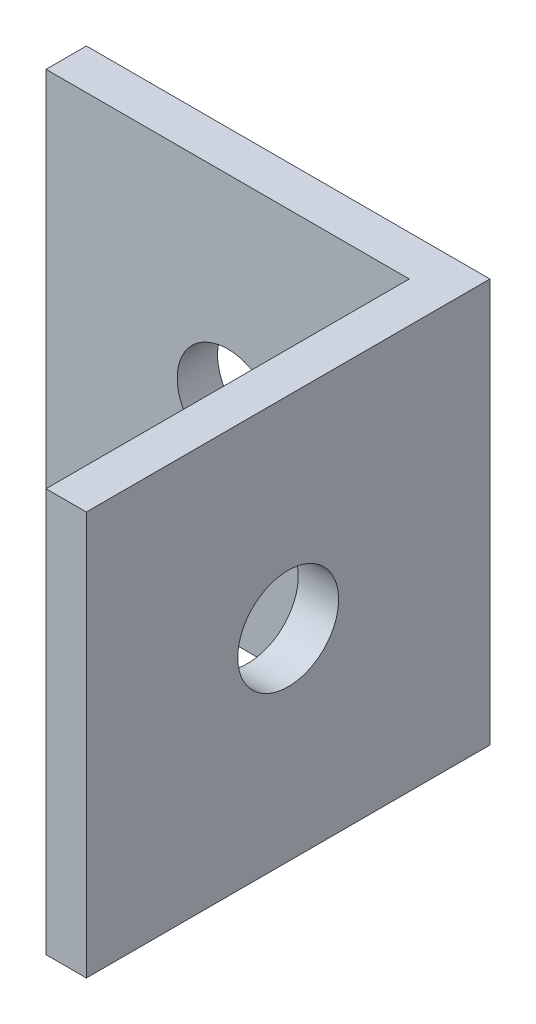
ISO-10303-21;
HEADER;
FILE_DESCRIPTION(('STEP AP214'),'2;1');
FILE_NAME('part.step','',(''),(''),'','','');
FILE_SCHEMA(('AUTOMOTIVE_DESIGN { 1 0 10303 214 1 1 1 1 }'));
ENDSEC;
DATA;
#1=APPLICATION_CONTEXT('core data for automotive mechanical design processes');
#2=APPLICATION_PROTOCOL_DEFINITION('international standard','automotive_design',2000,#1);
#3=PRODUCT_CONTEXT('',#1,'mechanical');
#4=PRODUCT('Part','Part','',(#3));
#5=PRODUCT_RELATED_PRODUCT_CATEGORY('part','',(#4));
#6=PRODUCT_DEFINITION_FORMATION('','',#4);
#7=PRODUCT_DEFINITION_CONTEXT('part definition',#1,'design');
#8=PRODUCT_DEFINITION('design','',#6,#7);
#9=PRODUCT_DEFINITION_SHAPE('','',#8);
#10=(LENGTH_UNIT() NAMED_UNIT(*) SI_UNIT(.MILLI.,.METRE.));
#11=(NAMED_UNIT(*) PLANE_ANGLE_UNIT() SI_UNIT($,.RADIAN.));
#12=(NAMED_UNIT(*) SI_UNIT($,.STERADIAN.) SOLID_ANGLE_UNIT());
#13=UNCERTAINTY_MEASURE_WITH_UNIT(LENGTH_MEASURE(1.E-05),#10,'distance_accuracy_value','');
#14=(GEOMETRIC_REPRESENTATION_CONTEXT(3) GLOBAL_UNCERTAINTY_ASSIGNED_CONTEXT((#13)) GLOBAL_UNIT_ASSIGNED_CONTEXT((#10,
#11,#12)) REPRESENTATION_CONTEXT('',''));
#15=CARTESIAN_POINT('',(0.,0.,0.));
#16=DIRECTION('',(0.,0.,1.));
#17=DIRECTION('',(1.,0.,0.));
#18=AXIS2_PLACEMENT_3D('',#15,#16,#17);
#19=CARTESIAN_POINT('',(0.,0.,2.54));
#20=DIRECTION('',(0.,0.,-1.));
#21=DIRECTION('',(-1.,0.,0.));
#22=AXIS2_PLACEMENT_3D('',#19,#20,#21);
#23=PLANE('',#22);
#24=CARTESIAN_POINT('',(11.43,12.7,2.54));
#25=DIRECTION('',(0.,0.,1.));
#26=DIRECTION('',(1.,0.,0.));
#27=AXIS2_PLACEMENT_3D('',#24,#25,#26);
#28=CIRCLE('',#27,3.175);
#29=CARTESIAN_POINT('',(14.605,12.7,2.54));
#30=VERTEX_POINT('',#29);
#31=EDGE_CURVE('E276',#30,#30,#28,.T.);
#32=ORIENTED_EDGE('',*,*,#31,.F.);
#33=EDGE_LOOP('',(#32));
#34=FACE_BOUND('',#33,.T.);
#35=DIRECTION('',(0.,-1.,0.));
#36=VECTOR('',#35,1.);
#37=CARTESIAN_POINT('',(22.86,0.,2.54));
#38=LINE('',#37,#36);
#39=CARTESIAN_POINT('',(22.86,25.4,2.54));
#40=VERTEX_POINT('',#39);
#41=CARTESIAN_POINT('',(22.86,0.,2.54));
#42=VERTEX_POINT('',#41);
#43=EDGE_CURVE('E55',#40,#42,#38,.T.);
#44=ORIENTED_EDGE('',*,*,#43,.F.);
#45=DIRECTION('',(-1.,0.,0.));
#46=VECTOR('',#45,1.);
#47=CARTESIAN_POINT('',(0.,25.4,2.54));
#48=LINE('',#47,#46);
#49=CARTESIAN_POINT('',(0.,25.4,2.54));
#50=VERTEX_POINT('',#49);
#51=EDGE_CURVE('E98',#40,#50,#48,.T.);
#52=ORIENTED_EDGE('',*,*,#51,.T.);
#53=DIRECTION('',(0.,-1.,0.));
#54=VECTOR('',#53,1.);
#55=CARTESIAN_POINT('',(0.,0.,2.54));
#56=LINE('',#55,#54);
#57=CARTESIAN_POINT('',(0.,0.,2.54));
#58=VERTEX_POINT('',#57);
#59=EDGE_CURVE('E131',#50,#58,#56,.T.);
#60=ORIENTED_EDGE('',*,*,#59,.T.);
#61=DIRECTION('',(1.,0.,0.));
#62=VECTOR('',#61,1.);
#63=CARTESIAN_POINT('',(0.,0.,2.54));
#64=LINE('',#63,#62);
#65=EDGE_CURVE('E60',#58,#42,#64,.T.);
#66=ORIENTED_EDGE('',*,*,#65,.T.);
#67=EDGE_LOOP('',(#44,#52,#60,#66));
#68=FACE_BOUND('',#67,.T.);
#69=ADVANCED_FACE('F39',(#34,#68),#23,.F.);
#70=CARTESIAN_POINT('',(0.,0.,2.54));
#71=DIRECTION('',(1.,0.,0.));
#72=DIRECTION('',(0.,0.,-1.));
#73=AXIS2_PLACEMENT_3D('',#70,#71,#72);
#74=PLANE('',#73);
#75=DIRECTION('',(0.,-1.,0.));
#76=VECTOR('',#75,1.);
#77=CARTESIAN_POINT('',(0.,0.,0.));
#78=LINE('',#77,#76);
#79=CARTESIAN_POINT('',(0.,25.4,0.));
#80=VERTEX_POINT('',#79);
#81=CARTESIAN_POINT('',(0.,0.,0.));
#82=VERTEX_POINT('',#81);
#83=EDGE_CURVE('E130',#80,#82,#78,.T.);
#84=ORIENTED_EDGE('',*,*,#83,.T.);
#85=DIRECTION('',(0.,0.,-1.));
#86=VECTOR('',#85,1.);
#87=CARTESIAN_POINT('',(0.,0.,2.54));
#88=LINE('',#87,#86);
#89=EDGE_CURVE('E11',#58,#82,#88,.T.);
#90=ORIENTED_EDGE('',*,*,#89,.F.);
#91=ORIENTED_EDGE('',*,*,#59,.F.);
#92=DIRECTION('',(0.,0.,-1.));
#93=VECTOR('',#92,1.);
#94=CARTESIAN_POINT('',(0.,25.4,2.54));
#95=LINE('',#94,#93);
#96=EDGE_CURVE('E139',#50,#80,#95,.T.);
#97=ORIENTED_EDGE('',*,*,#96,.T.);
#98=EDGE_LOOP('',(#84,#90,#91,#97));
#99=FACE_BOUND('',#98,.T.);
#100=ADVANCED_FACE('F41',(#99),#74,.F.);
#101=CARTESIAN_POINT('',(0.,0.,2.54));
#102=DIRECTION('',(0.,1.,0.));
#103=DIRECTION('',(0.,0.,1.));
#104=AXIS2_PLACEMENT_3D('',#101,#102,#103);
#105=PLANE('',#104);
#106=DIRECTION('',(0.,0.,-1.));
#107=VECTOR('',#106,1.);
#108=CARTESIAN_POINT('',(25.4,0.,2.54));
#109=LINE('',#108,#107);
#110=CARTESIAN_POINT('',(25.4,0.,25.4));
#111=VERTEX_POINT('',#110);
#112=CARTESIAN_POINT('',(25.4,0.,0.));
#113=VERTEX_POINT('',#112);
#114=EDGE_CURVE('E48',#111,#113,#109,.T.);
#115=ORIENTED_EDGE('',*,*,#114,.F.);
#116=DIRECTION('',(1.,0.,0.));
#117=VECTOR('',#116,1.);
#118=CARTESIAN_POINT('',(22.86,0.,25.4));
#119=LINE('',#118,#117);
#120=CARTESIAN_POINT('',(22.86,0.,25.4));
#121=VERTEX_POINT('',#120);
#122=EDGE_CURVE('E112',#121,#111,#119,.T.);
#123=ORIENTED_EDGE('',*,*,#122,.F.);
#124=DIRECTION('',(0.,0.,-1.));
#125=VECTOR('',#124,1.);
#126=CARTESIAN_POINT('',(22.86,0.,0.));
#127=LINE('',#126,#125);
#128=EDGE_CURVE('E113',#121,#42,#127,.T.);
#129=ORIENTED_EDGE('',*,*,#128,.T.);
#130=ORIENTED_EDGE('',*,*,#65,.F.);
#131=ORIENTED_EDGE('',*,*,#89,.T.);
#132=DIRECTION('',(1.,0.,0.));
#133=VECTOR('',#132,1.);
#134=CARTESIAN_POINT('',(0.,0.,0.));
#135=LINE('',#134,#133);
#136=EDGE_CURVE('E143',#82,#113,#135,.T.);
#137=ORIENTED_EDGE('',*,*,#136,.T.);
#138=EDGE_LOOP('',(#115,#123,#129,#130,#131,#137));
#139=FACE_BOUND('',#138,.T.);
#140=ADVANCED_FACE('F175',(#139),#105,.F.);
#141=CARTESIAN_POINT('',(25.4,0.,2.54));
#142=DIRECTION('',(-1.,0.,0.));
#143=DIRECTION('',(0.,0.,1.));
#144=AXIS2_PLACEMENT_3D('',#141,#142,#143);
#145=PLANE('',#144);
#146=CARTESIAN_POINT('',(25.4,12.7,12.7));
#147=DIRECTION('',(-1.,0.,0.));
#148=DIRECTION('',(0.,0.,1.));
#149=AXIS2_PLACEMENT_3D('',#146,#147,#148);
#150=CIRCLE('',#149,3.175);
#151=CARTESIAN_POINT('',(25.4,12.7,15.875));
#152=VERTEX_POINT('',#151);
#153=EDGE_CURVE('E269',#152,#152,#150,.T.);
#154=ORIENTED_EDGE('',*,*,#153,.T.);
#155=EDGE_LOOP('',(#154));
#156=FACE_BOUND('',#155,.T.);
#157=DIRECTION('',(0.,1.,0.));
#158=VECTOR('',#157,1.);
#159=CARTESIAN_POINT('',(25.4,0.,0.));
#160=LINE('',#159,#158);
#161=CARTESIAN_POINT('',(25.4,25.4,0.));
#162=VERTEX_POINT('',#161);
#163=EDGE_CURVE('E146',#113,#162,#160,.T.);
#164=ORIENTED_EDGE('',*,*,#163,.T.);
#165=DIRECTION('',(0.,0.,-1.));
#166=VECTOR('',#165,1.);
#167=CARTESIAN_POINT('',(25.4,25.4,2.54));
#168=LINE('',#167,#166);
#169=CARTESIAN_POINT('',(25.4,25.4,25.4));
#170=VERTEX_POINT('',#169);
#171=EDGE_CURVE('E154',#170,#162,#168,.T.);
#172=ORIENTED_EDGE('',*,*,#171,.F.);
#173=DIRECTION('',(0.,-1.,0.));
#174=VECTOR('',#173,1.);
#175=CARTESIAN_POINT('',(25.4,0.,25.4));
#176=LINE('',#175,#174);
#177=EDGE_CURVE('E103',#170,#111,#176,.T.);
#178=ORIENTED_EDGE('',*,*,#177,.T.);
#179=ORIENTED_EDGE('',*,*,#114,.T.);
#180=EDGE_LOOP('',(#164,#172,#178,#179));
#181=FACE_BOUND('',#180,.T.);
#182=ADVANCED_FACE('F160',(#156,#181),#145,.F.);
#183=CARTESIAN_POINT('',(0.,25.4,2.54));
#184=DIRECTION('',(0.,-1.,0.));
#185=DIRECTION('',(0.,0.,-1.));
#186=AXIS2_PLACEMENT_3D('',#183,#184,#185);
#187=PLANE('',#186);
#188=DIRECTION('',(-1.,0.,0.));
#189=VECTOR('',#188,1.);
#190=CARTESIAN_POINT('',(0.,25.4,0.));
#191=LINE('',#190,#189);
#192=EDGE_CURVE('E134',#162,#80,#191,.T.);
#193=ORIENTED_EDGE('',*,*,#192,.T.);
#194=ORIENTED_EDGE('',*,*,#96,.F.);
#195=ORIENTED_EDGE('',*,*,#51,.F.);
#196=DIRECTION('',(0.,0.,1.));
#197=VECTOR('',#196,1.);
#198=CARTESIAN_POINT('',(22.86,25.4,0.));
#199=LINE('',#198,#197);
#200=CARTESIAN_POINT('',(22.86,25.4,25.4));
#201=VERTEX_POINT('',#200);
#202=EDGE_CURVE('E91',#40,#201,#199,.T.);
#203=ORIENTED_EDGE('',*,*,#202,.T.);
#204=DIRECTION('',(1.,0.,0.));
#205=VECTOR('',#204,1.);
#206=CARTESIAN_POINT('',(22.86,25.4,25.4));
#207=LINE('',#206,#205);
#208=EDGE_CURVE('E95',#201,#170,#207,.T.);
#209=ORIENTED_EDGE('',*,*,#208,.T.);
#210=ORIENTED_EDGE('',*,*,#171,.T.);
#211=EDGE_LOOP('',(#193,#194,#195,#203,#209,#210));
#212=FACE_BOUND('',#211,.T.);
#213=ADVANCED_FACE('F93',(#212),#187,.F.);
#214=CARTESIAN_POINT('',(0.,0.,0.));
#215=DIRECTION('',(0.,0.,-1.));
#216=DIRECTION('',(-1.,0.,0.));
#217=AXIS2_PLACEMENT_3D('',#214,#215,#216);
#218=PLANE('',#217);
#219=CARTESIAN_POINT('',(11.43,12.7,0.));
#220=DIRECTION('',(0.,0.,1.));
#221=DIRECTION('',(1.,0.,0.));
#222=AXIS2_PLACEMENT_3D('',#219,#220,#221);
#223=CIRCLE('',#222,3.175);
#224=CARTESIAN_POINT('',(14.605,12.7,0.));
#225=VERTEX_POINT('',#224);
#226=EDGE_CURVE('E125',#225,#225,#223,.T.);
#227=ORIENTED_EDGE('',*,*,#226,.T.);
#228=EDGE_LOOP('',(#227));
#229=FACE_BOUND('',#228,.T.);
#230=ORIENTED_EDGE('',*,*,#163,.F.);
#231=ORIENTED_EDGE('',*,*,#136,.F.);
#232=ORIENTED_EDGE('',*,*,#83,.F.);
#233=ORIENTED_EDGE('',*,*,#192,.F.);
#234=EDGE_LOOP('',(#230,#231,#232,#233));
#235=FACE_BOUND('',#234,.T.);
#236=ADVANCED_FACE('F164',(#229,#235),#218,.T.);
#237=CARTESIAN_POINT('',(22.86,0.,0.));
#238=DIRECTION('',(1.,0.,0.));
#239=DIRECTION('',(0.,0.,-1.));
#240=AXIS2_PLACEMENT_3D('',#237,#238,#239);
#241=PLANE('',#240);
#242=CARTESIAN_POINT('',(22.86,12.7,12.7));
#243=DIRECTION('',(-1.,0.,0.));
#244=DIRECTION('',(0.,0.,1.));
#245=AXIS2_PLACEMENT_3D('',#242,#243,#244);
#246=CIRCLE('',#245,3.175);
#247=CARTESIAN_POINT('',(22.86,12.7,15.875));
#248=VERTEX_POINT('',#247);
#249=EDGE_CURVE('E272',#248,#248,#246,.T.);
#250=ORIENTED_EDGE('',*,*,#249,.F.);
#251=EDGE_LOOP('',(#250));
#252=FACE_BOUND('',#251,.T.);
#253=ORIENTED_EDGE('',*,*,#202,.F.);
#254=ORIENTED_EDGE('',*,*,#43,.T.);
#255=ORIENTED_EDGE('',*,*,#128,.F.);
#256=DIRECTION('',(0.,-1.,0.));
#257=VECTOR('',#256,1.);
#258=CARTESIAN_POINT('',(22.86,0.,25.4));
#259=LINE('',#258,#257);
#260=EDGE_CURVE('E102',#201,#121,#259,.T.);
#261=ORIENTED_EDGE('',*,*,#260,.F.);
#262=EDGE_LOOP('',(#253,#254,#255,#261));
#263=FACE_BOUND('',#262,.T.);
#264=ADVANCED_FACE('F115',(#252,#263),#241,.F.);
#265=CARTESIAN_POINT('',(22.86,0.,25.4));
#266=DIRECTION('',(0.,0.,1.));
#267=DIRECTION('',(0.,-1.,0.));
#268=AXIS2_PLACEMENT_3D('',#265,#266,#267);
#269=PLANE('',#268);
#270=ORIENTED_EDGE('',*,*,#177,.F.);
#271=ORIENTED_EDGE('',*,*,#208,.F.);
#272=ORIENTED_EDGE('',*,*,#260,.T.);
#273=ORIENTED_EDGE('',*,*,#122,.T.);
#274=EDGE_LOOP('',(#270,#271,#272,#273));
#275=FACE_BOUND('',#274,.T.);
#276=ADVANCED_FACE('F107',(#275),#269,.T.);
#277=CARTESIAN_POINT('',(11.43,12.7,0.));
#278=DIRECTION('',(0.,0.,1.));
#279=DIRECTION('',(1.,0.,0.));
#280=AXIS2_PLACEMENT_3D('',#277,#278,#279);
#281=CYLINDRICAL_SURFACE('',#280,3.175);
#282=ORIENTED_EDGE('',*,*,#226,.F.);
#283=EDGE_LOOP('',(#282));
#284=FACE_BOUND('',#283,.T.);
#285=ORIENTED_EDGE('',*,*,#31,.T.);
#286=EDGE_LOOP('',(#285));
#287=FACE_BOUND('',#286,.T.);
#288=ADVANCED_FACE('F218',(#284,#287),#281,.F.);
#289=CARTESIAN_POINT('',(25.4,12.7,12.7));
#290=DIRECTION('',(-1.,0.,0.));
#291=DIRECTION('',(0.,0.,1.));
#292=AXIS2_PLACEMENT_3D('',#289,#290,#291);
#293=CYLINDRICAL_SURFACE('',#292,3.175);
#294=ORIENTED_EDGE('',*,*,#153,.F.);
#295=EDGE_LOOP('',(#294));
#296=FACE_BOUND('',#295,.T.);
#297=ORIENTED_EDGE('',*,*,#249,.T.);
#298=EDGE_LOOP('',(#297));
#299=FACE_BOUND('',#298,.T.);
#300=ADVANCED_FACE('F223',(#296,#299),#293,.F.);
#301=CLOSED_SHELL('',(#69,#100,#140,#182,#213,#236,#264,#276,#288,#300));
#302=MANIFOLD_SOLID_BREP('B2',#301);
#303=ADVANCED_BREP_SHAPE_REPRESENTATION('',(#18,#302),#14);
#304=SHAPE_DEFINITION_REPRESENTATION(#9,#303);
ENDSEC;
END-ISO-10303-21;
